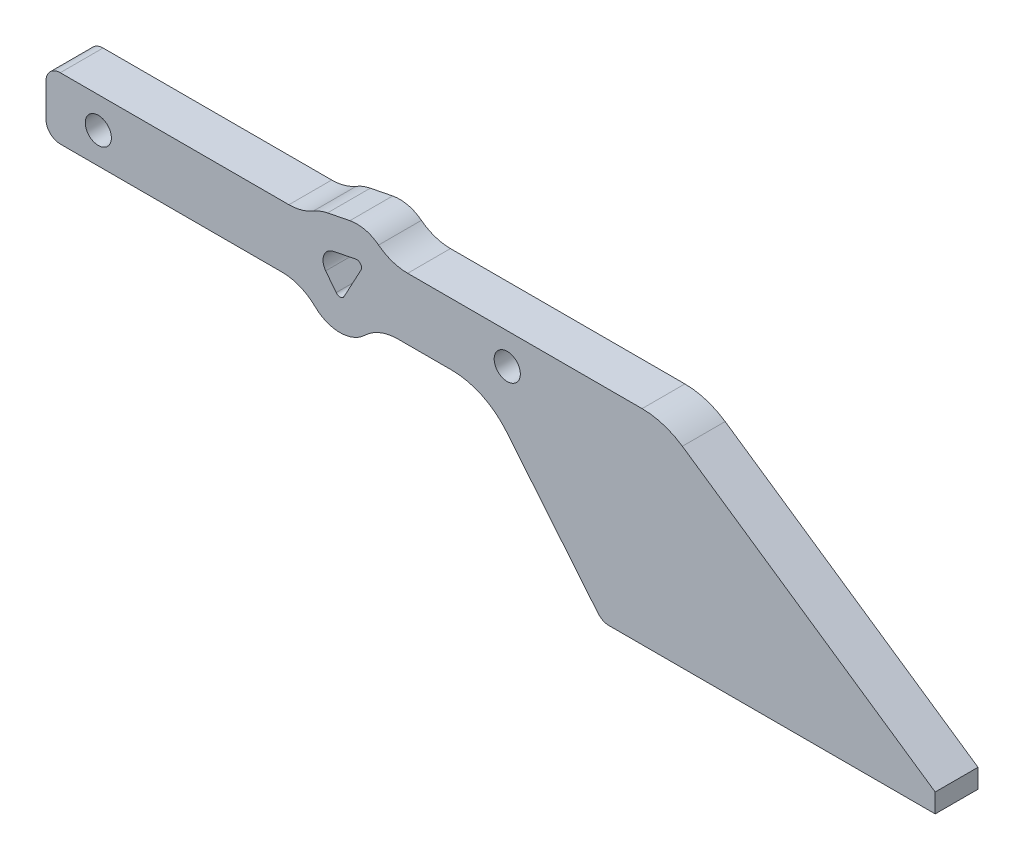
ISO-10303-21;
HEADER;
FILE_DESCRIPTION(('STEP AP214'),'2;1');
FILE_NAME('part.step','',(''),(''),'','','');
FILE_SCHEMA(('AUTOMOTIVE_DESIGN { 1 0 10303 214 1 1 1 1 }'));
ENDSEC;
DATA;
#1=APPLICATION_CONTEXT('core data for automotive mechanical design processes');
#2=APPLICATION_PROTOCOL_DEFINITION('international standard','automotive_design',2000,#1);
#3=PRODUCT_CONTEXT('',#1,'mechanical');
#4=PRODUCT('Part','Part','',(#3));
#5=PRODUCT_RELATED_PRODUCT_CATEGORY('part','',(#4));
#6=PRODUCT_DEFINITION_FORMATION('','',#4);
#7=PRODUCT_DEFINITION_CONTEXT('part definition',#1,'design');
#8=PRODUCT_DEFINITION('design','',#6,#7);
#9=PRODUCT_DEFINITION_SHAPE('','',#8);
#10=(LENGTH_UNIT() NAMED_UNIT(*) SI_UNIT(.MILLI.,.METRE.));
#11=(NAMED_UNIT(*) PLANE_ANGLE_UNIT() SI_UNIT($,.RADIAN.));
#12=(NAMED_UNIT(*) SI_UNIT($,.STERADIAN.) SOLID_ANGLE_UNIT());
#13=UNCERTAINTY_MEASURE_WITH_UNIT(LENGTH_MEASURE(1.E-05),#10,'distance_accuracy_value','');
#14=(GEOMETRIC_REPRESENTATION_CONTEXT(3) GLOBAL_UNCERTAINTY_ASSIGNED_CONTEXT((#13)) GLOBAL_UNIT_ASSIGNED_CONTEXT((#10,
#11,#12)) REPRESENTATION_CONTEXT('',''));
#15=CARTESIAN_POINT('',(0.,0.,0.));
#16=DIRECTION('',(0.,0.,1.));
#17=DIRECTION('',(1.,0.,0.));
#18=AXIS2_PLACEMENT_3D('',#15,#16,#17);
#19=CARTESIAN_POINT('',(-12.2422787166719,61.8280255007025,4.5));
#20=DIRECTION('',(0.194234351219974,-0.980955155349191,0.));
#21=DIRECTION('',(0.980955155349191,0.194234351219974,0.));
#22=AXIS2_PLACEMENT_3D('',#19,#20,#21);
#23=PLANE('',#22);
#24=DIRECTION('',(-0.980955155349191,-0.194234351219974,0.));
#25=VECTOR('',#24,1.);
#26=CARTESIAN_POINT('',(-12.2422787166719,61.8280255007025,-4.5));
#27=LINE('',#26,#25);
#28=CARTESIAN_POINT('',(-121.83136029778,40.1288030177724,-4.5));
#29=VERTEX_POINT('',#28);
#30=CARTESIAN_POINT('',(-126.534144465855,39.1976266772103,-4.5));
#31=VERTEX_POINT('',#30);
#32=EDGE_CURVE('E390',#29,#31,#27,.T.);
#33=ORIENTED_EDGE('',*,*,#32,.F.);
#34=DIRECTION('',(0.,0.,-1.));
#35=VECTOR('',#34,1.);
#36=CARTESIAN_POINT('',(-121.83136029778,40.1288030177724,4.5));
#37=LINE('',#36,#35);
#38=CARTESIAN_POINT('',(-121.83136029778,40.1288030177724,4.5));
#39=VERTEX_POINT('',#38);
#40=EDGE_CURVE('E433',#39,#29,#37,.T.);
#41=ORIENTED_EDGE('',*,*,#40,.F.);
#42=DIRECTION('',(-0.980955155349191,-0.194234351219974,0.));
#43=VECTOR('',#42,1.);
#44=CARTESIAN_POINT('',(-12.2422787166719,61.8280255007025,4.5));
#45=LINE('',#44,#43);
#46=CARTESIAN_POINT('',(-126.534144465855,39.1976266772103,4.5));
#47=VERTEX_POINT('',#46);
#48=EDGE_CURVE('E312',#39,#47,#45,.T.);
#49=ORIENTED_EDGE('',*,*,#48,.T.);
#50=DIRECTION('',(0.,0.,-1.));
#51=VECTOR('',#50,1.);
#52=CARTESIAN_POINT('',(-126.534144465855,39.1976266772103,4.5));
#53=LINE('',#52,#51);
#54=EDGE_CURVE('E251',#47,#31,#53,.T.);
#55=ORIENTED_EDGE('',*,*,#54,.T.);
#56=EDGE_LOOP('',(#33,#41,#49,#55));
#57=FACE_BOUND('',#56,.T.);
#58=ADVANCED_FACE('F44',(#57),#23,.T.);
#59=CARTESIAN_POINT('',(-121.63712594656,39.1478478624232,4.5));
#60=DIRECTION('',(0.,0.,-1.));
#61=DIRECTION('',(-1.,0.,0.));
#62=AXIS2_PLACEMENT_3D('',#59,#60,#61);
#63=CYLINDRICAL_SURFACE('',#62,0.999999999999998);
#64=CARTESIAN_POINT('',(-121.63712594656,39.1478478624232,-4.5));
#65=DIRECTION('',(0.,0.,1.));
#66=DIRECTION('',(1.,0.,0.));
#67=AXIS2_PLACEMENT_3D('',#64,#65,#66);
#68=CIRCLE('',#67,0.999999999999998);
#69=CARTESIAN_POINT('',(-120.757075345755,38.6729679407337,-4.5));
#70=VERTEX_POINT('',#69);
#71=EDGE_CURVE('E394',#29,#70,#68,.F.);
#72=ORIENTED_EDGE('',*,*,#71,.T.);
#73=DIRECTION('',(0.,0.,-1.));
#74=VECTOR('',#73,1.);
#75=CARTESIAN_POINT('',(-120.757075345755,38.6729679407337,4.5));
#76=LINE('',#75,#74);
#77=CARTESIAN_POINT('',(-120.757075345755,38.6729679407337,4.5));
#78=VERTEX_POINT('',#77);
#79=EDGE_CURVE('E429',#78,#70,#76,.T.);
#80=ORIENTED_EDGE('',*,*,#79,.F.);
#81=CARTESIAN_POINT('',(-121.63712594656,39.1478478624232,4.5));
#82=DIRECTION('',(0.,0.,1.));
#83=DIRECTION('',(1.,0.,0.));
#84=AXIS2_PLACEMENT_3D('',#81,#82,#83);
#85=CIRCLE('',#84,0.999999999999998);
#86=EDGE_CURVE('E316',#39,#78,#85,.F.);
#87=ORIENTED_EDGE('',*,*,#86,.F.);
#88=ORIENTED_EDGE('',*,*,#40,.T.);
#89=EDGE_LOOP('',(#72,#80,#87,#88));
#90=FACE_BOUND('',#89,.T.);
#91=ADVANCED_FACE('F597',(#90),#63,.F.);
#92=CARTESIAN_POINT('',(-109.687177123316,59.1877762881579,4.5));
#93=DIRECTION('',(0.880050600804368,-0.474879921689548,0.));
#94=DIRECTION('',(0.474879921689548,0.880050600804368,0.));
#95=AXIS2_PLACEMENT_3D('',#92,#93,#94);
#96=PLANE('',#95);
#97=DIRECTION('',(-0.474879921689548,-0.880050600804368,0.));
#98=VECTOR('',#97,1.);
#99=CARTESIAN_POINT('',(-109.687177123316,59.1877762881579,-4.5));
#100=LINE('',#99,#98);
#101=CARTESIAN_POINT('',(-124.30475054433,32.0983928800392,-4.5));
#102=VERTEX_POINT('',#101);
#103=EDGE_CURVE('E398',#70,#102,#100,.T.);
#104=ORIENTED_EDGE('',*,*,#103,.T.);
#105=DIRECTION('',(0.,0.,-1.));
#106=VECTOR('',#105,1.);
#107=CARTESIAN_POINT('',(-124.30475054433,32.0983928800392,4.5));
#108=LINE('',#107,#106);
#109=CARTESIAN_POINT('',(-124.30475054433,32.0983928800392,4.5));
#110=VERTEX_POINT('',#109);
#111=EDGE_CURVE('E426',#110,#102,#108,.T.);
#112=ORIENTED_EDGE('',*,*,#111,.F.);
#113=DIRECTION('',(-0.474879921689548,-0.880050600804368,0.));
#114=VECTOR('',#113,1.);
#115=CARTESIAN_POINT('',(-109.687177123316,59.1877762881579,4.5));
#116=LINE('',#115,#114);
#117=EDGE_CURVE('E320',#78,#110,#116,.T.);
#118=ORIENTED_EDGE('',*,*,#117,.F.);
#119=ORIENTED_EDGE('',*,*,#79,.T.);
#120=EDGE_LOOP('',(#104,#112,#118,#119));
#121=FACE_BOUND('',#120,.T.);
#122=ADVANCED_FACE('F603',(#121),#96,.F.);
#123=CARTESIAN_POINT('',(-125.184801145135,32.5732728017288,4.5));
#124=DIRECTION('',(0.,0.,-1.));
#125=DIRECTION('',(-1.,0.,0.));
#126=AXIS2_PLACEMENT_3D('',#123,#124,#125);
#127=CYLINDRICAL_SURFACE('',#126,0.999999999999993);
#128=CARTESIAN_POINT('',(-125.184801145135,32.5732728017288,-4.5));
#129=DIRECTION('',(0.,0.,1.));
#130=DIRECTION('',(1.,0.,0.));
#131=AXIS2_PLACEMENT_3D('',#128,#129,#130);
#132=CIRCLE('',#131,0.999999999999993);
#133=CARTESIAN_POINT('',(-125.97709078849,31.9631276378275,-4.5));
#134=VERTEX_POINT('',#133);
#135=EDGE_CURVE('E402',#134,#102,#132,.T.);
#136=ORIENTED_EDGE('',*,*,#135,.F.);
#137=DIRECTION('',(0.,0.,-1.));
#138=VECTOR('',#137,1.);
#139=CARTESIAN_POINT('',(-125.97709078849,31.9631276378275,4.5));
#140=LINE('',#139,#138);
#141=CARTESIAN_POINT('',(-125.97709078849,31.9631276378275,4.5));
#142=VERTEX_POINT('',#141);
#143=EDGE_CURVE('E423',#142,#134,#140,.T.);
#144=ORIENTED_EDGE('',*,*,#143,.F.);
#145=CARTESIAN_POINT('',(-125.184801145135,32.5732728017288,4.5));
#146=DIRECTION('',(0.,0.,1.));
#147=DIRECTION('',(1.,0.,0.));
#148=AXIS2_PLACEMENT_3D('',#145,#146,#147);
#149=CIRCLE('',#148,0.999999999999993);
#150=EDGE_CURVE('E323',#142,#110,#149,.T.);
#151=ORIENTED_EDGE('',*,*,#150,.T.);
#152=ORIENTED_EDGE('',*,*,#111,.T.);
#153=EDGE_LOOP('',(#136,#144,#151,#152));
#154=FACE_BOUND('',#153,.T.);
#155=ADVANCED_FACE('F843',(#154),#127,.F.);
#156=CARTESIAN_POINT('',(-63.6273524271515,-48.9996577651376,4.5));
#157=DIRECTION('',(-0.792289643355197,-0.61014516390126,0.));
#158=DIRECTION('',(0.61014516390126,-0.792289643355197,0.));
#159=AXIS2_PLACEMENT_3D('',#156,#157,#158);
#160=PLANE('',#159);
#161=DIRECTION('',(-0.61014516390126,0.792289643355197,0.));
#162=VECTOR('',#161,1.);
#163=CARTESIAN_POINT('',(-63.6273524271515,-48.9996577651376,-4.5));
#164=LINE('',#163,#162);
#165=CARTESIAN_POINT('',(-128.178796519227,34.8221007992715,-4.5));
#166=VERTEX_POINT('',#165);
#167=EDGE_CURVE('E406',#134,#166,#164,.T.);
#168=ORIENTED_EDGE('',*,*,#167,.T.);
#169=DIRECTION('',(0.,0.,-1.));
#170=VECTOR('',#169,1.);
#171=CARTESIAN_POINT('',(-128.178796519227,34.8221007992715,4.5));
#172=LINE('',#171,#170);
#173=CARTESIAN_POINT('',(-128.178796519227,34.8221007992715,4.5));
#174=VERTEX_POINT('',#173);
#175=EDGE_CURVE('E420',#174,#166,#172,.T.);
#176=ORIENTED_EDGE('',*,*,#175,.F.);
#177=DIRECTION('',(-0.61014516390126,0.792289643355197,0.));
#178=VECTOR('',#177,1.);
#179=CARTESIAN_POINT('',(-63.6273524271515,-48.9996577651376,4.5));
#180=LINE('',#179,#178);
#181=EDGE_CURVE('E327',#142,#174,#180,.T.);
#182=ORIENTED_EDGE('',*,*,#181,.F.);
#183=ORIENTED_EDGE('',*,*,#143,.T.);
#184=EDGE_LOOP('',(#168,#176,#182,#183));
#185=FACE_BOUND('',#184,.T.);
#186=ADVANCED_FACE('F651',(#185),#160,.F.);
#187=CARTESIAN_POINT('',(0.,43.,4.5));
#188=DIRECTION('',(0.,-1.,0.));
#189=DIRECTION('',(1.,0.,0.));
#190=AXIS2_PLACEMENT_3D('',#187,#188,#189);
#191=PLANE('',#190);
#192=DIRECTION('',(-1.,0.,0.));
#193=VECTOR('',#192,1.);
#194=CARTESIAN_POINT('',(0.,43.,-4.5));
#195=LINE('',#194,#193);
#196=CARTESIAN_POINT('',(-61.6404563843569,43.,-4.5));
#197=VERTEX_POINT('',#196);
#198=CARTESIAN_POINT('',(-110.942833957025,43.,-4.5));
#199=VERTEX_POINT('',#198);
#200=EDGE_CURVE('E343',#197,#199,#195,.T.);
#201=ORIENTED_EDGE('',*,*,#200,.T.);
#202=DIRECTION('',(0.,0.,-1.));
#203=VECTOR('',#202,1.);
#204=CARTESIAN_POINT('',(-110.942833957025,43.,4.5));
#205=LINE('',#204,#203);
#206=CARTESIAN_POINT('',(-110.942833957025,43.,4.5));
#207=VERTEX_POINT('',#206);
#208=EDGE_CURVE('E484',#199,#207,#205,.F.);
#209=ORIENTED_EDGE('',*,*,#208,.T.);
#210=DIRECTION('',(-1.,0.,0.));
#211=VECTOR('',#210,1.);
#212=CARTESIAN_POINT('',(0.,43.,4.5));
#213=LINE('',#212,#211);
#214=CARTESIAN_POINT('',(-61.6404563843569,43.,4.5));
#215=VERTEX_POINT('',#214);
#216=EDGE_CURVE('E270',#215,#207,#213,.T.);
#217=ORIENTED_EDGE('',*,*,#216,.F.);
#218=DIRECTION('',(0.,0.,-1.));
#219=VECTOR('',#218,1.);
#220=CARTESIAN_POINT('',(-61.6404563843569,43.,-4.5));
#221=LINE('',#220,#219);
#222=EDGE_CURVE('E451',#215,#197,#221,.T.);
#223=ORIENTED_EDGE('',*,*,#222,.T.);
#224=EDGE_LOOP('',(#201,#209,#217,#223));
#225=FACE_BOUND('',#224,.T.);
#226=ADVANCED_FACE('F579',(#225),#191,.F.);
#227=CARTESIAN_POINT('',(-121.63712594656,39.1478478624232,4.5));
#228=DIRECTION('',(0.,0.,-1.));
#229=DIRECTION('',(-1.,0.,0.));
#230=AXIS2_PLACEMENT_3D('',#227,#228,#229);
#231=CYLINDRICAL_SURFACE('',#230,7.5);
#232=CARTESIAN_POINT('',(-121.63712594656,39.1478478624232,4.5));
#233=DIRECTION('',(0.,0.,1.));
#234=DIRECTION('',(1.,0.,0.));
#235=AXIS2_PLACEMENT_3D('',#232,#233,#234);
#236=CIRCLE('',#235,7.5);
#237=CARTESIAN_POINT('',(-123.09388358071,46.5050115275421,4.5));
#238=VERTEX_POINT('',#237);
#239=CARTESIAN_POINT('',(-117.053857951045,45.0844844928133,4.5));
#240=VERTEX_POINT('',#239);
#241=EDGE_CURVE('E244',#238,#240,#236,.F.);
#242=ORIENTED_EDGE('',*,*,#241,.T.);
#243=DIRECTION('',(0.,0.,-1.));
#244=VECTOR('',#243,1.);
#245=CARTESIAN_POINT('',(-117.053857951045,45.0844844928133,4.5));
#246=LINE('',#245,#244);
#247=CARTESIAN_POINT('',(-117.053857951045,45.0844844928133,-4.5));
#248=VERTEX_POINT('',#247);
#249=EDGE_CURVE('E481',#240,#248,#246,.T.);
#250=ORIENTED_EDGE('',*,*,#249,.T.);
#251=CARTESIAN_POINT('',(-121.63712594656,39.1478478624232,-4.5));
#252=DIRECTION('',(0.,0.,1.));
#253=DIRECTION('',(1.,0.,0.));
#254=AXIS2_PLACEMENT_3D('',#251,#252,#253);
#255=CIRCLE('',#254,7.5);
#256=CARTESIAN_POINT('',(-123.09388358071,46.5050115275421,-4.5));
#257=VERTEX_POINT('',#256);
#258=EDGE_CURVE('E247',#257,#248,#255,.F.);
#259=ORIENTED_EDGE('',*,*,#258,.F.);
#260=DIRECTION('',(0.,0.,-1.));
#261=VECTOR('',#260,1.);
#262=CARTESIAN_POINT('',(-123.09388358071,46.5050115275421,4.5));
#263=LINE('',#262,#261);
#264=EDGE_CURVE('E239',#238,#257,#263,.T.);
#265=ORIENTED_EDGE('',*,*,#264,.F.);
#266=EDGE_LOOP('',(#242,#250,#259,#265));
#267=FACE_BOUND('',#266,.T.);
#268=ADVANCED_FACE('F241',(#267),#231,.T.);
#269=CARTESIAN_POINT('',(-13.5048019996014,68.2042340104719,4.5));
#270=DIRECTION('',(0.194234351219971,-0.980955155349192,0.));
#271=DIRECTION('',(0.980955155349192,0.194234351219971,0.));
#272=AXIS2_PLACEMENT_3D('',#269,#270,#271);
#273=PLANE('',#272);
#274=DIRECTION('',(-0.980955155349192,-0.194234351219971,0.));
#275=VECTOR('',#274,1.);
#276=CARTESIAN_POINT('',(-13.5048019996014,68.2042340104719,-4.5));
#277=LINE('',#276,#275);
#278=CARTESIAN_POINT('',(-127.796667748785,45.57383518698,-4.5));
#279=VERTEX_POINT('',#278);
#280=EDGE_CURVE('E349',#257,#279,#277,.T.);
#281=ORIENTED_EDGE('',*,*,#280,.T.);
#282=DIRECTION('',(0.,0.,-1.));
#283=VECTOR('',#282,1.);
#284=CARTESIAN_POINT('',(-127.796667748785,45.57383518698,4.5));
#285=LINE('',#284,#283);
#286=CARTESIAN_POINT('',(-127.796667748785,45.57383518698,4.5));
#287=VERTEX_POINT('',#286);
#288=EDGE_CURVE('E252',#287,#279,#285,.T.);
#289=ORIENTED_EDGE('',*,*,#288,.F.);
#290=DIRECTION('',(-0.980955155349192,-0.194234351219971,0.));
#291=VECTOR('',#290,1.);
#292=CARTESIAN_POINT('',(-13.5048019996014,68.2042340104719,4.5));
#293=LINE('',#292,#291);
#294=EDGE_CURVE('E255',#238,#287,#293,.T.);
#295=ORIENTED_EDGE('',*,*,#294,.F.);
#296=ORIENTED_EDGE('',*,*,#264,.T.);
#297=EDGE_LOOP('',(#281,#289,#295,#296));
#298=FACE_BOUND('',#297,.T.);
#299=ADVANCED_FACE('F256',(#298),#273,.F.);
#300=CARTESIAN_POINT('',(-126.,36.5,4.5));
#301=DIRECTION('',(0.,0.,-1.));
#302=DIRECTION('',(-1.,0.,0.));
#303=AXIS2_PLACEMENT_3D('',#300,#301,#302);
#304=CYLINDRICAL_SURFACE('',#303,9.25000000000001);
#305=CARTESIAN_POINT('',(-126.,36.5,-4.5));
#306=DIRECTION('',(0.,0.,1.));
#307=DIRECTION('',(1.,0.,0.));
#308=AXIS2_PLACEMENT_3D('',#305,#306,#307);
#309=CIRCLE('',#308,9.25000000000001);
#310=CARTESIAN_POINT('',(-130.764478471149,44.4285714285714,-4.5));
#311=VERTEX_POINT('',#310);
#312=EDGE_CURVE('E352',#279,#311,#309,.T.);
#313=ORIENTED_EDGE('',*,*,#312,.T.);
#314=DIRECTION('',(0.,0.,-1.));
#315=VECTOR('',#314,1.);
#316=CARTESIAN_POINT('',(-130.764478471149,44.4285714285714,4.5));
#317=LINE('',#316,#315);
#318=CARTESIAN_POINT('',(-130.764478471149,44.4285714285714,4.5));
#319=VERTEX_POINT('',#318);
#320=EDGE_CURVE('E491',#311,#319,#317,.F.);
#321=ORIENTED_EDGE('',*,*,#320,.T.);
#322=CARTESIAN_POINT('',(-126.,36.5,4.5));
#323=DIRECTION('',(0.,0.,1.));
#324=DIRECTION('',(1.,0.,0.));
#325=AXIS2_PLACEMENT_3D('',#322,#323,#324);
#326=CIRCLE('',#325,9.25000000000001);
#327=EDGE_CURVE('E261',#287,#319,#326,.T.);
#328=ORIENTED_EDGE('',*,*,#327,.F.);
#329=ORIENTED_EDGE('',*,*,#288,.T.);
#330=EDGE_LOOP('',(#313,#321,#328,#329));
#331=FACE_BOUND('',#330,.T.);
#332=ADVANCED_FACE('F640',(#331),#304,.T.);
#333=CARTESIAN_POINT('',(0.,43.,4.5));
#334=DIRECTION('',(0.,-1.,0.));
#335=DIRECTION('',(1.,0.,0.));
#336=AXIS2_PLACEMENT_3D('',#333,#334,#335);
#337=PLANE('',#336);
#338=DIRECTION('',(-1.,0.,0.));
#339=VECTOR('',#338,1.);
#340=CARTESIAN_POINT('',(0.,43.,-4.5));
#341=LINE('',#340,#339);
#342=CARTESIAN_POINT('',(-135.915266007526,43.,-4.5));
#343=VERTEX_POINT('',#342);
#344=CARTESIAN_POINT('',(-184.,43.,-4.5));
#345=VERTEX_POINT('',#344);
#346=EDGE_CURVE('E356',#343,#345,#341,.T.);
#347=ORIENTED_EDGE('',*,*,#346,.T.);
#348=DIRECTION('',(0.,0.,-1.));
#349=VECTOR('',#348,1.);
#350=CARTESIAN_POINT('',(-184.,43.,4.5));
#351=LINE('',#350,#349);
#352=CARTESIAN_POINT('',(-184.,43.,4.5));
#353=VERTEX_POINT('',#352);
#354=EDGE_CURVE('E536',#345,#353,#351,.F.);
#355=ORIENTED_EDGE('',*,*,#354,.T.);
#356=DIRECTION('',(-1.,0.,0.));
#357=VECTOR('',#356,1.);
#358=CARTESIAN_POINT('',(0.,43.,4.5));
#359=LINE('',#358,#357);
#360=CARTESIAN_POINT('',(-135.915266007526,43.,4.5));
#361=VERTEX_POINT('',#360);
#362=EDGE_CURVE('E280',#361,#353,#359,.T.);
#363=ORIENTED_EDGE('',*,*,#362,.F.);
#364=DIRECTION('',(0.,0.,1.));
#365=VECTOR('',#364,1.);
#366=CARTESIAN_POINT('',(-135.915266007526,43.,-4.5));
#367=LINE('',#366,#365);
#368=EDGE_CURVE('E487',#361,#343,#367,.F.);
#369=ORIENTED_EDGE('',*,*,#368,.T.);
#370=EDGE_LOOP('',(#347,#355,#363,#369));
#371=FACE_BOUND('',#370,.T.);
#372=ADVANCED_FACE('F636',(#371),#337,.F.);
#373=CARTESIAN_POINT('',(-187.,0.,4.5));
#374=DIRECTION('',(1.,0.,0.));
#375=DIRECTION('',(0.,0.,-1.));
#376=AXIS2_PLACEMENT_3D('',#373,#374,#375);
#377=PLANE('',#376);
#378=DIRECTION('',(0.,-1.,0.));
#379=VECTOR('',#378,1.);
#380=CARTESIAN_POINT('',(-187.,0.,4.5));
#381=LINE('',#380,#379);
#382=CARTESIAN_POINT('',(-187.,40.,4.5));
#383=VERTEX_POINT('',#382);
#384=CARTESIAN_POINT('',(-187.,33.,4.5));
#385=VERTEX_POINT('',#384);
#386=EDGE_CURVE('E283',#383,#385,#381,.T.);
#387=ORIENTED_EDGE('',*,*,#386,.F.);
#388=DIRECTION('',(0.,0.,-1.));
#389=VECTOR('',#388,1.);
#390=CARTESIAN_POINT('',(-187.,40.,4.5));
#391=LINE('',#390,#389);
#392=CARTESIAN_POINT('',(-187.,40.,-4.5));
#393=VERTEX_POINT('',#392);
#394=EDGE_CURVE('E523',#383,#393,#391,.T.);
#395=ORIENTED_EDGE('',*,*,#394,.T.);
#396=DIRECTION('',(0.,-1.,0.));
#397=VECTOR('',#396,1.);
#398=CARTESIAN_POINT('',(-187.,0.,-4.5));
#399=LINE('',#398,#397);
#400=CARTESIAN_POINT('',(-187.,33.,-4.5));
#401=VERTEX_POINT('',#400);
#402=EDGE_CURVE('E360',#393,#401,#399,.T.);
#403=ORIENTED_EDGE('',*,*,#402,.T.);
#404=DIRECTION('',(0.,0.,-1.));
#405=VECTOR('',#404,1.);
#406=CARTESIAN_POINT('',(-187.,33.,4.5));
#407=LINE('',#406,#405);
#408=EDGE_CURVE('E520',#401,#385,#407,.F.);
#409=ORIENTED_EDGE('',*,*,#408,.T.);
#410=EDGE_LOOP('',(#387,#395,#403,#409));
#411=FACE_BOUND('',#410,.T.);
#412=ADVANCED_FACE('F632',(#411),#377,.F.);
#413=CARTESIAN_POINT('',(0.,30.,4.5));
#414=DIRECTION('',(0.,-1.,0.));
#415=DIRECTION('',(1.,0.,0.));
#416=AXIS2_PLACEMENT_3D('',#413,#414,#415);
#417=PLANE('',#416);
#418=DIRECTION('',(-1.,0.,0.));
#419=VECTOR('',#418,1.);
#420=CARTESIAN_POINT('',(0.,30.,4.5));
#421=LINE('',#420,#419);
#422=CARTESIAN_POINT('',(-137.357015859529,30.,4.5));
#423=VERTEX_POINT('',#422);
#424=CARTESIAN_POINT('',(-184.,30.,4.5));
#425=VERTEX_POINT('',#424);
#426=EDGE_CURVE('E287',#423,#425,#421,.T.);
#427=ORIENTED_EDGE('',*,*,#426,.T.);
#428=DIRECTION('',(0.,0.,-1.));
#429=VECTOR('',#428,1.);
#430=CARTESIAN_POINT('',(-184.,30.,-4.5));
#431=LINE('',#430,#429);
#432=CARTESIAN_POINT('',(-184.,30.,-4.5));
#433=VERTEX_POINT('',#432);
#434=EDGE_CURVE('E547',#425,#433,#431,.T.);
#435=ORIENTED_EDGE('',*,*,#434,.T.);
#436=DIRECTION('',(-1.,0.,0.));
#437=VECTOR('',#436,1.);
#438=CARTESIAN_POINT('',(0.,30.,-4.5));
#439=LINE('',#438,#437);
#440=CARTESIAN_POINT('',(-137.357015859529,30.,-4.5));
#441=VERTEX_POINT('',#440);
#442=EDGE_CURVE('E364',#441,#433,#439,.T.);
#443=ORIENTED_EDGE('',*,*,#442,.F.);
#444=DIRECTION('',(0.,0.,-1.));
#445=VECTOR('',#444,1.);
#446=CARTESIAN_POINT('',(-137.357015859529,30.,4.5));
#447=LINE('',#446,#445);
#448=EDGE_CURVE('E494',#441,#423,#447,.F.);
#449=ORIENTED_EDGE('',*,*,#448,.T.);
#450=EDGE_LOOP('',(#427,#435,#443,#449));
#451=FACE_BOUND('',#450,.T.);
#452=ADVANCED_FACE('F628',(#451),#417,.T.);
#453=CARTESIAN_POINT('',(-125.184801145135,32.5732728017288,4.5));
#454=DIRECTION('',(0.,0.,-1.));
#455=DIRECTION('',(-1.,0.,0.));
#456=AXIS2_PLACEMENT_3D('',#453,#454,#455);
#457=CYLINDRICAL_SURFACE('',#456,7.5);
#458=CARTESIAN_POINT('',(-125.184801145135,32.5732728017288,-4.5));
#459=DIRECTION('',(0.,0.,1.));
#460=DIRECTION('',(1.,0.,0.));
#461=AXIS2_PLACEMENT_3D('',#458,#459,#460);
#462=CIRCLE('',#461,7.5);
#463=CARTESIAN_POINT('',(-130.401464594161,27.1847273152736,-4.5));
#464=VERTEX_POINT('',#463);
#465=CARTESIAN_POINT('',(-119.968137696109,27.1847273152736,-4.5));
#466=VERTEX_POINT('',#465);
#467=EDGE_CURVE('E368',#464,#466,#462,.T.);
#468=ORIENTED_EDGE('',*,*,#467,.T.);
#469=DIRECTION('',(0.,0.,-1.));
#470=VECTOR('',#469,1.);
#471=CARTESIAN_POINT('',(-119.968137696109,27.1847273152736,4.5));
#472=LINE('',#471,#470);
#473=CARTESIAN_POINT('',(-119.968137696109,27.1847273152736,4.5));
#474=VERTEX_POINT('',#473);
#475=EDGE_CURVE('E478',#466,#474,#472,.F.);
#476=ORIENTED_EDGE('',*,*,#475,.T.);
#477=CARTESIAN_POINT('',(-125.184801145135,32.5732728017288,4.5));
#478=DIRECTION('',(0.,0.,1.));
#479=DIRECTION('',(1.,0.,0.));
#480=AXIS2_PLACEMENT_3D('',#477,#478,#479);
#481=CIRCLE('',#480,7.5);
#482=CARTESIAN_POINT('',(-130.401464594161,27.1847273152736,4.5));
#483=VERTEX_POINT('',#482);
#484=EDGE_CURVE('E291',#483,#474,#481,.T.);
#485=ORIENTED_EDGE('',*,*,#484,.F.);
#486=DIRECTION('',(0.,0.,-1.));
#487=VECTOR('',#486,1.);
#488=CARTESIAN_POINT('',(-130.401464594161,27.1847273152736,4.5));
#489=LINE('',#488,#487);
#490=EDGE_CURVE('E474',#483,#464,#489,.T.);
#491=ORIENTED_EDGE('',*,*,#490,.T.);
#492=EDGE_LOOP('',(#468,#476,#485,#491));
#493=FACE_BOUND('',#492,.T.);
#494=ADVANCED_FACE('F624',(#493),#457,.T.);
#495=CARTESIAN_POINT('',(0.,30.,4.5));
#496=DIRECTION('',(0.,-1.,0.));
#497=DIRECTION('',(1.,0.,0.));
#498=AXIS2_PLACEMENT_3D('',#495,#496,#497);
#499=PLANE('',#498);
#500=DIRECTION('',(-1.,0.,0.));
#501=VECTOR('',#500,1.);
#502=CARTESIAN_POINT('',(0.,30.,4.5));
#503=LINE('',#502,#501);
#504=CARTESIAN_POINT('',(-101.729457735111,30.,4.5));
#505=VERTEX_POINT('',#504);
#506=CARTESIAN_POINT('',(-113.012586430741,30.,4.5));
#507=VERTEX_POINT('',#506);
#508=EDGE_CURVE('E295',#505,#507,#503,.T.);
#509=ORIENTED_EDGE('',*,*,#508,.T.);
#510=DIRECTION('',(0.,0.,-1.));
#511=VECTOR('',#510,1.);
#512=CARTESIAN_POINT('',(-113.012586430741,30.,4.5));
#513=LINE('',#512,#511);
#514=CARTESIAN_POINT('',(-113.012586430741,30.,-4.5));
#515=VERTEX_POINT('',#514);
#516=EDGE_CURVE('E470',#507,#515,#513,.T.);
#517=ORIENTED_EDGE('',*,*,#516,.T.);
#518=DIRECTION('',(-1.,0.,0.));
#519=VECTOR('',#518,1.);
#520=CARTESIAN_POINT('',(0.,30.,-4.5));
#521=LINE('',#520,#519);
#522=CARTESIAN_POINT('',(-101.729457735111,30.,-4.5));
#523=VERTEX_POINT('',#522);
#524=EDGE_CURVE('E372',#523,#515,#521,.T.);
#525=ORIENTED_EDGE('',*,*,#524,.F.);
#526=DIRECTION('',(0.,0.,-1.));
#527=VECTOR('',#526,1.);
#528=CARTESIAN_POINT('',(-101.729457735111,30.,4.5));
#529=LINE('',#528,#527);
#530=EDGE_CURVE('E448',#523,#505,#529,.F.);
#531=ORIENTED_EDGE('',*,*,#530,.T.);
#532=EDGE_LOOP('',(#509,#517,#525,#531));
#533=FACE_BOUND('',#532,.T.);
#534=ADVANCED_FACE('F621',(#533),#499,.T.);
#535=CARTESIAN_POINT('',(-41.8036999531151,-34.3323414137163,4.5));
#536=DIRECTION('',(0.772784390121805,0.634668642981572,0.));
#537=DIRECTION('',(-0.634668642981572,0.772784390121805,0.));
#538=AXIS2_PLACEMENT_3D('',#535,#536,#537);
#539=PLANE('',#538);
#540=DIRECTION('',(0.634668642981572,-0.772784390121805,0.));
#541=VECTOR('',#540,1.);
#542=CARTESIAN_POINT('',(-41.8036999531151,-34.3323414137163,-4.5));
#543=LINE('',#542,#541);
#544=CARTESIAN_POINT('',(-90.1376918832842,24.5200296447236,-4.5));
#545=VERTEX_POINT('',#544);
#546=CARTESIAN_POINT('',(-70.900112733492,1.09599407105527,-4.5));
#547=VERTEX_POINT('',#546);
#548=EDGE_CURVE('E376',#545,#547,#543,.T.);
#549=ORIENTED_EDGE('',*,*,#548,.T.);
#550=DIRECTION('',(0.,0.,-1.));
#551=VECTOR('',#550,1.);
#552=CARTESIAN_POINT('',(-70.900112733492,1.09599407105528,4.5));
#553=LINE('',#552,#551);
#554=CARTESIAN_POINT('',(-70.900112733492,1.09599407105527,4.5));
#555=VERTEX_POINT('',#554);
#556=EDGE_CURVE('E11',#547,#555,#553,.F.);
#557=ORIENTED_EDGE('',*,*,#556,.T.);
#558=DIRECTION('',(0.634668642981572,-0.772784390121805,0.));
#559=VECTOR('',#558,1.);
#560=CARTESIAN_POINT('',(-41.8036999531151,-34.3323414137163,4.5));
#561=LINE('',#560,#559);
#562=CARTESIAN_POINT('',(-90.1376918832842,24.5200296447236,4.5));
#563=VERTEX_POINT('',#562);
#564=EDGE_CURVE('E299',#563,#555,#561,.T.);
#565=ORIENTED_EDGE('',*,*,#564,.F.);
#566=DIRECTION('',(0.,0.,-1.));
#567=VECTOR('',#566,1.);
#568=CARTESIAN_POINT('',(-90.1376918832842,24.5200296447236,4.5));
#569=LINE('',#568,#567);
#570=EDGE_CURVE('E436',#563,#545,#569,.T.);
#571=ORIENTED_EDGE('',*,*,#570,.T.);
#572=EDGE_LOOP('',(#549,#557,#565,#571));
#573=FACE_BOUND('',#572,.T.);
#574=ADVANCED_FACE('F618',(#573),#539,.F.);
#575=CARTESIAN_POINT('',(0.,0.,4.5));
#576=DIRECTION('',(0.,-1.,0.));
#577=DIRECTION('',(1.,0.,0.));
#578=AXIS2_PLACEMENT_3D('',#575,#576,#577);
#579=PLANE('',#578);
#580=DIRECTION('',(-1.,0.,0.));
#581=VECTOR('',#580,1.);
#582=CARTESIAN_POINT('',(0.,0.,4.5));
#583=LINE('',#582,#581);
#584=CARTESIAN_POINT('',(0.,0.,4.5));
#585=VERTEX_POINT('',#584);
#586=CARTESIAN_POINT('',(-68.5817595631266,0.,4.5));
#587=VERTEX_POINT('',#586);
#588=EDGE_CURVE('E302',#585,#587,#583,.T.);
#589=ORIENTED_EDGE('',*,*,#588,.T.);
#590=DIRECTION('',(0.,0.,-1.));
#591=VECTOR('',#590,1.);
#592=CARTESIAN_POINT('',(-68.5817595631266,0.,-4.5));
#593=LINE('',#592,#591);
#594=CARTESIAN_POINT('',(-68.5817595631266,0.,-4.5));
#595=VERTEX_POINT('',#594);
#596=EDGE_CURVE('E53',#587,#595,#593,.T.);
#597=ORIENTED_EDGE('',*,*,#596,.T.);
#598=DIRECTION('',(-1.,0.,0.));
#599=VECTOR('',#598,1.);
#600=CARTESIAN_POINT('',(0.,0.,-4.5));
#601=LINE('',#600,#599);
#602=CARTESIAN_POINT('',(0.,0.,-4.5));
#603=VERTEX_POINT('',#602);
#604=EDGE_CURVE('E379',#603,#595,#601,.T.);
#605=ORIENTED_EDGE('',*,*,#604,.F.);
#606=DIRECTION('',(0.,0.,-1.));
#607=VECTOR('',#606,1.);
#608=CARTESIAN_POINT('',(0.,0.,4.5));
#609=LINE('',#608,#607);
#610=EDGE_CURVE('E440',#585,#603,#609,.T.);
#611=ORIENTED_EDGE('',*,*,#610,.F.);
#612=EDGE_LOOP('',(#589,#597,#605,#611));
#613=FACE_BOUND('',#612,.T.);
#614=ADVANCED_FACE('F556',(#613),#579,.T.);
#615=CARTESIAN_POINT('',(0.,0.,4.5));
#616=DIRECTION('',(-1.,0.,0.));
#617=DIRECTION('',(0.,0.,1.));
#618=AXIS2_PLACEMENT_3D('',#615,#616,#617);
#619=PLANE('',#618);
#620=DIRECTION('',(0.,1.,0.));
#621=VECTOR('',#620,1.);
#622=CARTESIAN_POINT('',(0.,0.,-4.5));
#623=LINE('',#622,#621);
#624=CARTESIAN_POINT('',(0.,4.,-4.5));
#625=VERTEX_POINT('',#624);
#626=EDGE_CURVE('E383',#603,#625,#623,.T.);
#627=ORIENTED_EDGE('',*,*,#626,.T.);
#628=DIRECTION('',(0.,0.,-1.));
#629=VECTOR('',#628,1.);
#630=CARTESIAN_POINT('',(0.,4.,4.5));
#631=LINE('',#630,#629);
#632=CARTESIAN_POINT('',(0.,4.,4.5));
#633=VERTEX_POINT('',#632);
#634=EDGE_CURVE('E338',#633,#625,#631,.T.);
#635=ORIENTED_EDGE('',*,*,#634,.F.);
#636=DIRECTION('',(0.,1.,0.));
#637=VECTOR('',#636,1.);
#638=CARTESIAN_POINT('',(0.,0.,4.5));
#639=LINE('',#638,#637);
#640=EDGE_CURVE('E305',#585,#633,#639,.T.);
#641=ORIENTED_EDGE('',*,*,#640,.F.);
#642=ORIENTED_EDGE('',*,*,#610,.T.);
#643=EDGE_LOOP('',(#627,#635,#641,#642));
#644=FACE_BOUND('',#643,.T.);
#645=ADVANCED_FACE('F567',(#644),#619,.F.);
#646=CARTESIAN_POINT('',(-126.,36.5,4.5));
#647=DIRECTION('',(0.,0.,-1.));
#648=DIRECTION('',(-1.,0.,0.));
#649=AXIS2_PLACEMENT_3D('',#646,#647,#648);
#650=CYLINDRICAL_SURFACE('',#649,2.74999999999999);
#651=CARTESIAN_POINT('',(-126.,36.5,-4.5));
#652=DIRECTION('',(0.,0.,1.));
#653=DIRECTION('',(1.,0.,0.));
#654=AXIS2_PLACEMENT_3D('',#651,#652,#653);
#655=CIRCLE('',#654,2.74999999999999);
#656=EDGE_CURVE('E410',#31,#166,#655,.T.);
#657=ORIENTED_EDGE('',*,*,#656,.F.);
#658=ORIENTED_EDGE('',*,*,#54,.F.);
#659=CARTESIAN_POINT('',(-126.,36.5,4.5));
#660=DIRECTION('',(0.,0.,1.));
#661=DIRECTION('',(1.,0.,0.));
#662=AXIS2_PLACEMENT_3D('',#659,#660,#661);
#663=CIRCLE('',#662,2.74999999999999);
#664=EDGE_CURVE('E330',#47,#174,#663,.T.);
#665=ORIENTED_EDGE('',*,*,#664,.T.);
#666=ORIENTED_EDGE('',*,*,#175,.T.);
#667=EDGE_LOOP('',(#657,#658,#665,#666));
#668=FACE_BOUND('',#667,.T.);
#669=ADVANCED_FACE('F613',(#668),#650,.F.);
#670=CARTESIAN_POINT('',(1.86415094339622,2.72452830188679,4.5));
#671=DIRECTION('',(0.56468391559199,0.825307261249832,0.));
#672=DIRECTION('',(-0.825307261249832,0.56468391559199,0.));
#673=AXIS2_PLACEMENT_3D('',#670,#671,#672);
#674=PLANE('',#673);
#675=DIRECTION('',(0.825307261249832,-0.56468391559199,0.));
#676=VECTOR('',#675,1.);
#677=CARTESIAN_POINT('',(1.86415094339622,2.72452830188679,-4.5));
#678=LINE('',#677,#676);
#679=CARTESIAN_POINT('',(-53.1701976504771,40.3796089187475,-4.5));
#680=VERTEX_POINT('',#679);
#681=EDGE_CURVE('E387',#680,#625,#678,.T.);
#682=ORIENTED_EDGE('',*,*,#681,.F.);
#683=DIRECTION('',(0.,0.,-1.));
#684=VECTOR('',#683,1.);
#685=CARTESIAN_POINT('',(-53.1701976504771,40.3796089187475,4.5));
#686=LINE('',#685,#684);
#687=CARTESIAN_POINT('',(-53.1701976504771,40.3796089187475,4.5));
#688=VERTEX_POINT('',#687);
#689=EDGE_CURVE('E458',#680,#688,#686,.F.);
#690=ORIENTED_EDGE('',*,*,#689,.T.);
#691=DIRECTION('',(0.825307261249832,-0.56468391559199,0.));
#692=VECTOR('',#691,1.);
#693=CARTESIAN_POINT('',(1.86415094339622,2.72452830188679,4.5));
#694=LINE('',#693,#692);
#695=EDGE_CURVE('E309',#688,#633,#694,.T.);
#696=ORIENTED_EDGE('',*,*,#695,.T.);
#697=ORIENTED_EDGE('',*,*,#634,.T.);
#698=EDGE_LOOP('',(#682,#690,#696,#697));
#699=FACE_BOUND('',#698,.T.);
#700=ADVANCED_FACE('F609',(#699),#674,.T.);
#701=CARTESIAN_POINT('',(-90.,36.5,4.5));
#702=DIRECTION('',(0.,0.,-1.));
#703=DIRECTION('',(-1.,0.,0.));
#704=AXIS2_PLACEMENT_3D('',#701,#702,#703);
#705=CYLINDRICAL_SURFACE('',#704,2.75000000000001);
#706=CARTESIAN_POINT('',(-90.,36.5,4.5));
#707=DIRECTION('',(0.,0.,1.));
#708=DIRECTION('',(1.,0.,0.));
#709=AXIS2_PLACEMENT_3D('',#706,#707,#708);
#710=CIRCLE('',#709,2.75000000000001);
#711=CARTESIAN_POINT('',(-87.25,36.5,4.5));
#712=VERTEX_POINT('',#711);
#713=EDGE_CURVE('E274',#712,#712,#710,.T.);
#714=ORIENTED_EDGE('',*,*,#713,.T.);
#715=EDGE_LOOP('',(#714));
#716=FACE_BOUND('',#715,.T.);
#717=CARTESIAN_POINT('',(-90.,36.5,-4.5));
#718=DIRECTION('',(0.,0.,1.));
#719=DIRECTION('',(1.,0.,0.));
#720=AXIS2_PLACEMENT_3D('',#717,#718,#719);
#721=CIRCLE('',#720,2.75000000000001);
#722=CARTESIAN_POINT('',(-87.25,36.5,-4.5));
#723=VERTEX_POINT('',#722);
#724=EDGE_CURVE('E339',#723,#723,#721,.T.);
#725=ORIENTED_EDGE('',*,*,#724,.F.);
#726=EDGE_LOOP('',(#725));
#727=FACE_BOUND('',#726,.T.);
#728=ADVANCED_FACE('F612',(#716,#727),#705,.F.);
#729=CARTESIAN_POINT('',(-176.,36.5,4.5));
#730=DIRECTION('',(0.,0.,-1.));
#731=DIRECTION('',(-1.,0.,0.));
#732=AXIS2_PLACEMENT_3D('',#729,#730,#731);
#733=CYLINDRICAL_SURFACE('',#732,2.75000000000001);
#734=CARTESIAN_POINT('',(-176.,36.5,4.5));
#735=DIRECTION('',(0.,0.,1.));
#736=DIRECTION('',(1.,0.,0.));
#737=AXIS2_PLACEMENT_3D('',#734,#735,#736);
#738=CIRCLE('',#737,2.75000000000001);
#739=CARTESIAN_POINT('',(-173.25,36.5,4.5));
#740=VERTEX_POINT('',#739);
#741=EDGE_CURVE('E334',#740,#740,#738,.T.);
#742=ORIENTED_EDGE('',*,*,#741,.T.);
#743=EDGE_LOOP('',(#742));
#744=FACE_BOUND('',#743,.T.);
#745=CARTESIAN_POINT('',(-176.,36.5,-4.5));
#746=DIRECTION('',(0.,0.,1.));
#747=DIRECTION('',(1.,0.,0.));
#748=AXIS2_PLACEMENT_3D('',#745,#746,#747);
#749=CIRCLE('',#748,2.75000000000001);
#750=CARTESIAN_POINT('',(-173.25,36.5,-4.5));
#751=VERTEX_POINT('',#750);
#752=EDGE_CURVE('E414',#751,#751,#749,.T.);
#753=ORIENTED_EDGE('',*,*,#752,.F.);
#754=EDGE_LOOP('',(#753));
#755=FACE_BOUND('',#754,.T.);
#756=ADVANCED_FACE('F654',(#744,#755),#733,.F.);
#757=CARTESIAN_POINT('',(0.,0.,4.5));
#758=DIRECTION('',(0.,0.,1.));
#759=DIRECTION('',(1.,0.,0.));
#760=AXIS2_PLACEMENT_3D('',#757,#758,#759);
#761=PLANE('',#760);
#762=ORIENTED_EDGE('',*,*,#713,.F.);
#763=EDGE_LOOP('',(#762));
#764=FACE_BOUND('',#763,.T.);
#765=ORIENTED_EDGE('',*,*,#362,.T.);
#766=CARTESIAN_POINT('',(-184.,40.,4.5));
#767=DIRECTION('',(0.,0.,1.));
#768=DIRECTION('',(1.,0.,0.));
#769=AXIS2_PLACEMENT_3D('',#766,#767,#768);
#770=CIRCLE('',#769,3.);
#771=EDGE_CURVE('E544',#353,#383,#770,.T.);
#772=ORIENTED_EDGE('',*,*,#771,.T.);
#773=ORIENTED_EDGE('',*,*,#386,.T.);
#774=CARTESIAN_POINT('',(-184.,33.,4.5));
#775=DIRECTION('',(0.,0.,1.));
#776=DIRECTION('',(1.,0.,0.));
#777=AXIS2_PLACEMENT_3D('',#774,#775,#776);
#778=CIRCLE('',#777,3.);
#779=EDGE_CURVE('E541',#385,#425,#778,.T.);
#780=ORIENTED_EDGE('',*,*,#779,.T.);
#781=ORIENTED_EDGE('',*,*,#426,.F.);
#782=CARTESIAN_POINT('',(-137.357015859529,20.,4.5));
#783=DIRECTION('',(0.,0.,1.));
#784=DIRECTION('',(1.,0.,0.));
#785=AXIS2_PLACEMENT_3D('',#782,#783,#784);
#786=CIRCLE('',#785,10.);
#787=EDGE_CURVE('E517',#423,#483,#786,.F.);
#788=ORIENTED_EDGE('',*,*,#787,.T.);
#789=ORIENTED_EDGE('',*,*,#484,.T.);
#790=CARTESIAN_POINT('',(-113.012586430741,20.,4.5));
#791=DIRECTION('',(0.,0.,1.));
#792=DIRECTION('',(1.,0.,0.));
#793=AXIS2_PLACEMENT_3D('',#790,#791,#792);
#794=CIRCLE('',#793,10.);
#795=EDGE_CURVE('E500',#474,#507,#794,.F.);
#796=ORIENTED_EDGE('',*,*,#795,.T.);
#797=ORIENTED_EDGE('',*,*,#508,.F.);
#798=CARTESIAN_POINT('',(-101.729457735111,15.,4.5));
#799=DIRECTION('',(0.,0.,1.));
#800=DIRECTION('',(1.,0.,0.));
#801=AXIS2_PLACEMENT_3D('',#798,#799,#800);
#802=CIRCLE('',#801,15.);
#803=EDGE_CURVE('E467',#505,#563,#802,.F.);
#804=ORIENTED_EDGE('',*,*,#803,.T.);
#805=ORIENTED_EDGE('',*,*,#564,.T.);
#806=CARTESIAN_POINT('',(-68.5817595631266,2.99999999999999,4.5));
#807=DIRECTION('',(0.,0.,1.));
#808=DIRECTION('',(1.,0.,0.));
#809=AXIS2_PLACEMENT_3D('',#806,#807,#808);
#810=CIRCLE('',#809,3.);
#811=EDGE_CURVE('E60',#555,#587,#810,.T.);
#812=ORIENTED_EDGE('',*,*,#811,.T.);
#813=ORIENTED_EDGE('',*,*,#588,.F.);
#814=ORIENTED_EDGE('',*,*,#640,.T.);
#815=ORIENTED_EDGE('',*,*,#695,.F.);
#816=CARTESIAN_POINT('',(-61.6404563843569,28.,4.5));
#817=DIRECTION('',(0.,0.,1.));
#818=DIRECTION('',(1.,0.,0.));
#819=AXIS2_PLACEMENT_3D('',#816,#817,#818);
#820=CIRCLE('',#819,15.);
#821=EDGE_CURVE('E461',#688,#215,#820,.T.);
#822=ORIENTED_EDGE('',*,*,#821,.T.);
#823=ORIENTED_EDGE('',*,*,#216,.T.);
#824=CARTESIAN_POINT('',(-110.942833957025,53.,4.5));
#825=DIRECTION('',(0.,0.,1.));
#826=DIRECTION('',(1.,0.,0.));
#827=AXIS2_PLACEMENT_3D('',#824,#825,#826);
#828=CIRCLE('',#827,10.);
#829=EDGE_CURVE('E268',#207,#240,#828,.F.);
#830=ORIENTED_EDGE('',*,*,#829,.T.);
#831=ORIENTED_EDGE('',*,*,#241,.F.);
#832=ORIENTED_EDGE('',*,*,#294,.T.);
#833=ORIENTED_EDGE('',*,*,#327,.T.);
#834=CARTESIAN_POINT('',(-135.915266007526,53.,4.5));
#835=DIRECTION('',(0.,0.,1.));
#836=DIRECTION('',(1.,0.,0.));
#837=AXIS2_PLACEMENT_3D('',#834,#835,#836);
#838=CIRCLE('',#837,10.);
#839=EDGE_CURVE('E511',#319,#361,#838,.F.);
#840=ORIENTED_EDGE('',*,*,#839,.T.);
#841=EDGE_LOOP('',(#765,#772,#773,#780,#781,#788,#789,#796,#797,#804,#805,#812,#813,#814,#815,
#822,#823,#830,#831,#832,#833,#840));
#842=FACE_BOUND('',#841,.T.);
#843=ORIENTED_EDGE('',*,*,#48,.F.);
#844=ORIENTED_EDGE('',*,*,#86,.T.);
#845=ORIENTED_EDGE('',*,*,#117,.T.);
#846=ORIENTED_EDGE('',*,*,#150,.F.);
#847=ORIENTED_EDGE('',*,*,#181,.T.);
#848=ORIENTED_EDGE('',*,*,#664,.F.);
#849=EDGE_LOOP('',(#843,#844,#845,#846,#847,#848));
#850=FACE_BOUND('',#849,.T.);
#851=ORIENTED_EDGE('',*,*,#741,.F.);
#852=EDGE_LOOP('',(#851));
#853=FACE_BOUND('',#852,.T.);
#854=ADVANCED_FACE('F264',(#764,#842,#850,#853),#761,.T.);
#855=CARTESIAN_POINT('',(0.,0.,-4.5));
#856=DIRECTION('',(0.,0.,1.));
#857=DIRECTION('',(1.,0.,0.));
#858=AXIS2_PLACEMENT_3D('',#855,#856,#857);
#859=PLANE('',#858);
#860=ORIENTED_EDGE('',*,*,#724,.T.);
#861=EDGE_LOOP('',(#860));
#862=FACE_BOUND('',#861,.T.);
#863=ORIENTED_EDGE('',*,*,#402,.F.);
#864=CARTESIAN_POINT('',(-184.,40.,-4.5));
#865=DIRECTION('',(0.,0.,1.));
#866=DIRECTION('',(1.,0.,0.));
#867=AXIS2_PLACEMENT_3D('',#864,#865,#866);
#868=CIRCLE('',#867,3.);
#869=EDGE_CURVE('E533',#393,#345,#868,.F.);
#870=ORIENTED_EDGE('',*,*,#869,.T.);
#871=ORIENTED_EDGE('',*,*,#346,.F.);
#872=CARTESIAN_POINT('',(-135.915266007526,53.,-4.5));
#873=DIRECTION('',(0.,0.,1.));
#874=DIRECTION('',(1.,0.,0.));
#875=AXIS2_PLACEMENT_3D('',#872,#873,#874);
#876=CIRCLE('',#875,10.);
#877=EDGE_CURVE('E508',#343,#311,#876,.T.);
#878=ORIENTED_EDGE('',*,*,#877,.T.);
#879=ORIENTED_EDGE('',*,*,#312,.F.);
#880=ORIENTED_EDGE('',*,*,#280,.F.);
#881=ORIENTED_EDGE('',*,*,#258,.T.);
#882=CARTESIAN_POINT('',(-110.942833957025,53.,-4.5));
#883=DIRECTION('',(0.,0.,1.));
#884=DIRECTION('',(1.,0.,0.));
#885=AXIS2_PLACEMENT_3D('',#882,#883,#884);
#886=CIRCLE('',#885,10.);
#887=EDGE_CURVE('E503',#248,#199,#886,.T.);
#888=ORIENTED_EDGE('',*,*,#887,.T.);
#889=ORIENTED_EDGE('',*,*,#200,.F.);
#890=CARTESIAN_POINT('',(-61.6404563843569,28.,-4.5));
#891=DIRECTION('',(0.,0.,1.));
#892=DIRECTION('',(1.,0.,0.));
#893=AXIS2_PLACEMENT_3D('',#890,#891,#892);
#894=CIRCLE('',#893,15.);
#895=EDGE_CURVE('E455',#197,#680,#894,.F.);
#896=ORIENTED_EDGE('',*,*,#895,.T.);
#897=ORIENTED_EDGE('',*,*,#681,.T.);
#898=ORIENTED_EDGE('',*,*,#626,.F.);
#899=ORIENTED_EDGE('',*,*,#604,.T.);
#900=CARTESIAN_POINT('',(-68.5817595631266,2.99999999999999,-4.5));
#901=DIRECTION('',(0.,0.,1.));
#902=DIRECTION('',(1.,0.,0.));
#903=AXIS2_PLACEMENT_3D('',#900,#901,#902);
#904=CIRCLE('',#903,3.);
#905=EDGE_CURVE('E527',#595,#547,#904,.F.);
#906=ORIENTED_EDGE('',*,*,#905,.T.);
#907=ORIENTED_EDGE('',*,*,#548,.F.);
#908=CARTESIAN_POINT('',(-101.729457735111,15.,-4.5));
#909=DIRECTION('',(0.,0.,1.));
#910=DIRECTION('',(1.,0.,0.));
#911=AXIS2_PLACEMENT_3D('',#908,#909,#910);
#912=CIRCLE('',#911,15.);
#913=EDGE_CURVE('E464',#545,#523,#912,.T.);
#914=ORIENTED_EDGE('',*,*,#913,.T.);
#915=ORIENTED_EDGE('',*,*,#524,.T.);
#916=CARTESIAN_POINT('',(-113.012586430741,20.,-4.5));
#917=DIRECTION('',(0.,0.,1.));
#918=DIRECTION('',(1.,0.,0.));
#919=AXIS2_PLACEMENT_3D('',#916,#917,#918);
#920=CIRCLE('',#919,10.);
#921=EDGE_CURVE('E497',#515,#466,#920,.T.);
#922=ORIENTED_EDGE('',*,*,#921,.T.);
#923=ORIENTED_EDGE('',*,*,#467,.F.);
#924=CARTESIAN_POINT('',(-137.357015859529,20.,-4.5));
#925=DIRECTION('',(0.,0.,1.));
#926=DIRECTION('',(1.,0.,0.));
#927=AXIS2_PLACEMENT_3D('',#924,#925,#926);
#928=CIRCLE('',#927,10.);
#929=EDGE_CURVE('E514',#464,#441,#928,.T.);
#930=ORIENTED_EDGE('',*,*,#929,.T.);
#931=ORIENTED_EDGE('',*,*,#442,.T.);
#932=CARTESIAN_POINT('',(-184.,33.,-4.5));
#933=DIRECTION('',(0.,0.,1.));
#934=DIRECTION('',(1.,0.,0.));
#935=AXIS2_PLACEMENT_3D('',#932,#933,#934);
#936=CIRCLE('',#935,3.);
#937=EDGE_CURVE('E530',#433,#401,#936,.F.);
#938=ORIENTED_EDGE('',*,*,#937,.T.);
#939=EDGE_LOOP('',(#863,#870,#871,#878,#879,#880,#881,#888,#889,#896,#897,#898,#899,#906,#907,
#914,#915,#922,#923,#930,#931,#938));
#940=FACE_BOUND('',#939,.T.);
#941=ORIENTED_EDGE('',*,*,#32,.T.);
#942=ORIENTED_EDGE('',*,*,#656,.T.);
#943=ORIENTED_EDGE('',*,*,#167,.F.);
#944=ORIENTED_EDGE('',*,*,#135,.T.);
#945=ORIENTED_EDGE('',*,*,#103,.F.);
#946=ORIENTED_EDGE('',*,*,#71,.F.);
#947=EDGE_LOOP('',(#941,#942,#943,#944,#945,#946));
#948=FACE_BOUND('',#947,.T.);
#949=ORIENTED_EDGE('',*,*,#752,.T.);
#950=EDGE_LOOP('',(#949));
#951=FACE_BOUND('',#950,.T.);
#952=ADVANCED_FACE('F561',(#862,#940,#948,#951),#859,.F.);
#953=CARTESIAN_POINT('',(-101.729457735111,15.,4.5));
#954=DIRECTION('',(0.,0.,-1.));
#955=DIRECTION('',(-1.,0.,0.));
#956=AXIS2_PLACEMENT_3D('',#953,#954,#955);
#957=CYLINDRICAL_SURFACE('',#956,15.);
#958=ORIENTED_EDGE('',*,*,#803,.F.);
#959=ORIENTED_EDGE('',*,*,#530,.F.);
#960=ORIENTED_EDGE('',*,*,#913,.F.);
#961=ORIENTED_EDGE('',*,*,#570,.F.);
#962=EDGE_LOOP('',(#958,#959,#960,#961));
#963=FACE_BOUND('',#962,.T.);
#964=ADVANCED_FACE('F656',(#963),#957,.F.);
#965=CARTESIAN_POINT('',(-61.6404563843569,28.,4.5));
#966=DIRECTION('',(0.,0.,1.));
#967=DIRECTION('',(1.,0.,0.));
#968=AXIS2_PLACEMENT_3D('',#965,#966,#967);
#969=CYLINDRICAL_SURFACE('',#968,15.);
#970=ORIENTED_EDGE('',*,*,#821,.F.);
#971=ORIENTED_EDGE('',*,*,#689,.F.);
#972=ORIENTED_EDGE('',*,*,#895,.F.);
#973=ORIENTED_EDGE('',*,*,#222,.F.);
#974=EDGE_LOOP('',(#970,#971,#972,#973));
#975=FACE_BOUND('',#974,.T.);
#976=ADVANCED_FACE('F576',(#975),#969,.T.);
#977=CARTESIAN_POINT('',(-113.012586430741,20.,4.5));
#978=DIRECTION('',(0.,0.,-1.));
#979=DIRECTION('',(-1.,0.,0.));
#980=AXIS2_PLACEMENT_3D('',#977,#978,#979);
#981=CYLINDRICAL_SURFACE('',#980,10.);
#982=ORIENTED_EDGE('',*,*,#795,.F.);
#983=ORIENTED_EDGE('',*,*,#475,.F.);
#984=ORIENTED_EDGE('',*,*,#921,.F.);
#985=ORIENTED_EDGE('',*,*,#516,.F.);
#986=EDGE_LOOP('',(#982,#983,#984,#985));
#987=FACE_BOUND('',#986,.T.);
#988=ADVANCED_FACE('F585',(#987),#981,.F.);
#989=CARTESIAN_POINT('',(-110.942833957025,53.,4.5));
#990=DIRECTION('',(0.,0.,-1.));
#991=DIRECTION('',(-1.,0.,0.));
#992=AXIS2_PLACEMENT_3D('',#989,#990,#991);
#993=CYLINDRICAL_SURFACE('',#992,10.);
#994=ORIENTED_EDGE('',*,*,#829,.F.);
#995=ORIENTED_EDGE('',*,*,#208,.F.);
#996=ORIENTED_EDGE('',*,*,#887,.F.);
#997=ORIENTED_EDGE('',*,*,#249,.F.);
#998=EDGE_LOOP('',(#994,#995,#996,#997));
#999=FACE_BOUND('',#998,.T.);
#1000=ADVANCED_FACE('F582',(#999),#993,.F.);
#1001=CARTESIAN_POINT('',(-135.915266007526,53.,4.5));
#1002=DIRECTION('',(0.,0.,-1.));
#1003=DIRECTION('',(-1.,0.,0.));
#1004=AXIS2_PLACEMENT_3D('',#1001,#1002,#1003);
#1005=CYLINDRICAL_SURFACE('',#1004,10.);
#1006=ORIENTED_EDGE('',*,*,#839,.F.);
#1007=ORIENTED_EDGE('',*,*,#320,.F.);
#1008=ORIENTED_EDGE('',*,*,#877,.F.);
#1009=ORIENTED_EDGE('',*,*,#368,.F.);
#1010=EDGE_LOOP('',(#1006,#1007,#1008,#1009));
#1011=FACE_BOUND('',#1010,.T.);
#1012=ADVANCED_FACE('F584',(#1011),#1005,.F.);
#1013=CARTESIAN_POINT('',(-137.357015859529,20.,4.5));
#1014=DIRECTION('',(0.,0.,-1.));
#1015=DIRECTION('',(-1.,0.,0.));
#1016=AXIS2_PLACEMENT_3D('',#1013,#1014,#1015);
#1017=CYLINDRICAL_SURFACE('',#1016,10.);
#1018=ORIENTED_EDGE('',*,*,#787,.F.);
#1019=ORIENTED_EDGE('',*,*,#448,.F.);
#1020=ORIENTED_EDGE('',*,*,#929,.F.);
#1021=ORIENTED_EDGE('',*,*,#490,.F.);
#1022=EDGE_LOOP('',(#1018,#1019,#1020,#1021));
#1023=FACE_BOUND('',#1022,.T.);
#1024=ADVANCED_FACE('F591',(#1023),#1017,.F.);
#1025=CARTESIAN_POINT('',(-184.,40.,4.5));
#1026=DIRECTION('',(0.,0.,-1.));
#1027=DIRECTION('',(-1.,0.,0.));
#1028=AXIS2_PLACEMENT_3D('',#1025,#1026,#1027);
#1029=CYLINDRICAL_SURFACE('',#1028,3.);
#1030=ORIENTED_EDGE('',*,*,#771,.F.);
#1031=ORIENTED_EDGE('',*,*,#354,.F.);
#1032=ORIENTED_EDGE('',*,*,#869,.F.);
#1033=ORIENTED_EDGE('',*,*,#394,.F.);
#1034=EDGE_LOOP('',(#1030,#1031,#1032,#1033));
#1035=FACE_BOUND('',#1034,.T.);
#1036=ADVANCED_FACE('F690',(#1035),#1029,.T.);
#1037=CARTESIAN_POINT('',(-184.,33.,4.5));
#1038=DIRECTION('',(0.,0.,1.));
#1039=DIRECTION('',(1.,0.,0.));
#1040=AXIS2_PLACEMENT_3D('',#1037,#1038,#1039);
#1041=CYLINDRICAL_SURFACE('',#1040,3.);
#1042=ORIENTED_EDGE('',*,*,#779,.F.);
#1043=ORIENTED_EDGE('',*,*,#408,.F.);
#1044=ORIENTED_EDGE('',*,*,#937,.F.);
#1045=ORIENTED_EDGE('',*,*,#434,.F.);
#1046=EDGE_LOOP('',(#1042,#1043,#1044,#1045));
#1047=FACE_BOUND('',#1046,.T.);
#1048=ADVANCED_FACE('F701',(#1047),#1041,.T.);
#1049=CARTESIAN_POINT('',(-68.5817595631266,2.99999999999999,4.5));
#1050=DIRECTION('',(0.,0.,1.));
#1051=DIRECTION('',(1.,0.,0.));
#1052=AXIS2_PLACEMENT_3D('',#1049,#1050,#1051);
#1053=CYLINDRICAL_SURFACE('',#1052,3.);
#1054=ORIENTED_EDGE('',*,*,#811,.F.);
#1055=ORIENTED_EDGE('',*,*,#556,.F.);
#1056=ORIENTED_EDGE('',*,*,#905,.F.);
#1057=ORIENTED_EDGE('',*,*,#596,.F.);
#1058=EDGE_LOOP('',(#1054,#1055,#1056,#1057));
#1059=FACE_BOUND('',#1058,.T.);
#1060=ADVANCED_FACE('F46',(#1059),#1053,.T.);
#1061=CLOSED_SHELL('',(#58,#91,#122,#155,#186,#226,#268,#299,#332,#372,#412,#452,#494,#534,#574,
#614,#645,#669,#700,#728,#756,#854,#952,#964,#976,#988,#1000,#1012,#1024,#1036,#1048,#1060));
#1062=MANIFOLD_SOLID_BREP('B2',#1061);
#1063=ADVANCED_BREP_SHAPE_REPRESENTATION('',(#18,#1062),#14);
#1064=SHAPE_DEFINITION_REPRESENTATION(#9,#1063);
ENDSEC;
END-ISO-10303-21;
